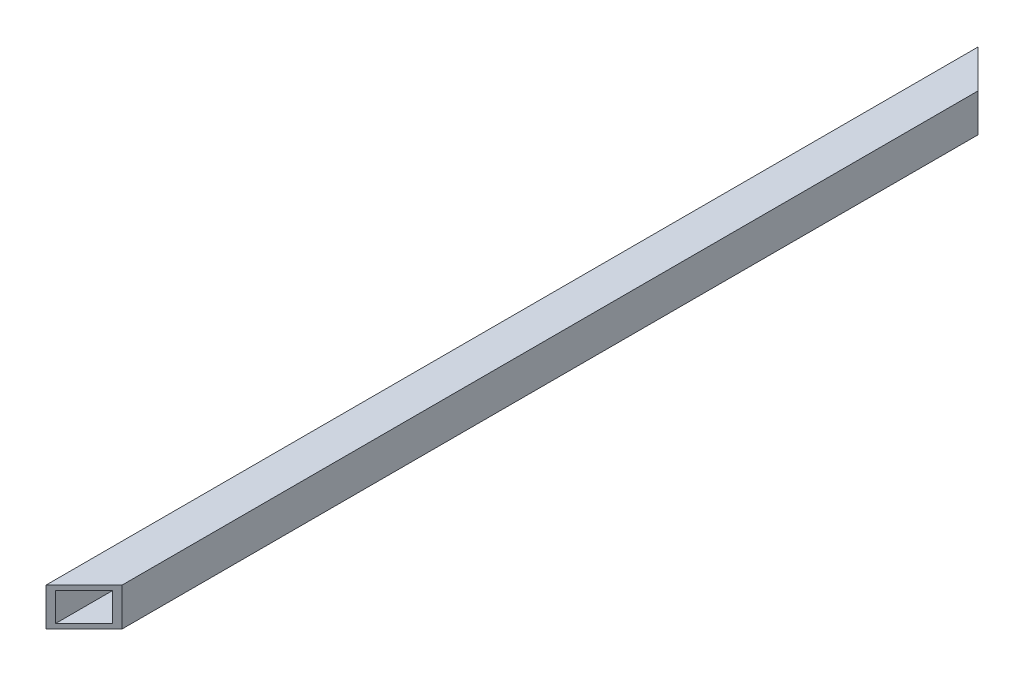
ISO-10303-21;
HEADER;
FILE_DESCRIPTION(('STEP AP214'),'2;1');
FILE_NAME('part.step','',(''),(''),'','','');
FILE_SCHEMA(('AUTOMOTIVE_DESIGN { 1 0 10303 214 1 1 1 1 }'));
ENDSEC;
DATA;
#1=APPLICATION_CONTEXT('core data for automotive mechanical design processes');
#2=APPLICATION_PROTOCOL_DEFINITION('international standard','automotive_design',2000,#1);
#3=PRODUCT_CONTEXT('',#1,'mechanical');
#4=PRODUCT('Part','Part','',(#3));
#5=PRODUCT_RELATED_PRODUCT_CATEGORY('part','',(#4));
#6=PRODUCT_DEFINITION_FORMATION('','',#4);
#7=PRODUCT_DEFINITION_CONTEXT('part definition',#1,'design');
#8=PRODUCT_DEFINITION('design','',#6,#7);
#9=PRODUCT_DEFINITION_SHAPE('','',#8);
#10=(LENGTH_UNIT() NAMED_UNIT(*) SI_UNIT(.MILLI.,.METRE.));
#11=(NAMED_UNIT(*) PLANE_ANGLE_UNIT() SI_UNIT($,.RADIAN.));
#12=(NAMED_UNIT(*) SI_UNIT($,.STERADIAN.) SOLID_ANGLE_UNIT());
#13=UNCERTAINTY_MEASURE_WITH_UNIT(LENGTH_MEASURE(1.E-05),#10,'distance_accuracy_value','');
#14=(GEOMETRIC_REPRESENTATION_CONTEXT(3) GLOBAL_UNCERTAINTY_ASSIGNED_CONTEXT((#13)) GLOBAL_UNIT_ASSIGNED_CONTEXT((#10,
#11,#12)) REPRESENTATION_CONTEXT('',''));
#15=CARTESIAN_POINT('',(0.,0.,0.));
#16=DIRECTION('',(0.,0.,1.));
#17=DIRECTION('',(1.,0.,0.));
#18=AXIS2_PLACEMENT_3D('',#15,#16,#17);
#19=CARTESIAN_POINT('',(-12.7,12.7,-311.15));
#20=DIRECTION('',(-0.707106781186548,0.,0.707106781186547));
#21=DIRECTION('',(0.707106781186547,0.,0.707106781186548));
#22=AXIS2_PLACEMENT_3D('',#19,#20,#21);
#23=PLANE('',#22);
#24=DIRECTION('',(0.707106781186547,0.,0.707106781186548));
#25=VECTOR('',#24,1.);
#26=CARTESIAN_POINT('',(71.4375,-12.7,-227.0125));
#27=LINE('',#26,#25);
#28=CARTESIAN_POINT('',(-12.7,-12.7,-311.15));
#29=VERTEX_POINT('',#28);
#30=CARTESIAN_POINT('',(12.7,-12.7,-285.75));
#31=VERTEX_POINT('',#30);
#32=EDGE_CURVE('E10',#29,#31,#27,.T.);
#33=ORIENTED_EDGE('',*,*,#32,.F.);
#34=DIRECTION('',(0.,-1.,0.));
#35=VECTOR('',#34,1.);
#36=CARTESIAN_POINT('',(-12.7,-12.7,-311.15));
#37=LINE('',#36,#35);
#38=CARTESIAN_POINT('',(-12.7,12.7,-311.15));
#39=VERTEX_POINT('',#38);
#40=EDGE_CURVE('E35',#39,#29,#37,.T.);
#41=ORIENTED_EDGE('',*,*,#40,.F.);
#42=DIRECTION('',(-0.707106781186547,0.,-0.707106781186548));
#43=VECTOR('',#42,1.);
#44=CARTESIAN_POINT('',(65.0875,12.7,-233.3625));
#45=LINE('',#44,#43);
#46=CARTESIAN_POINT('',(12.7,12.7,-285.75));
#47=VERTEX_POINT('',#46);
#48=EDGE_CURVE('E130',#47,#39,#45,.T.);
#49=ORIENTED_EDGE('',*,*,#48,.F.);
#50=DIRECTION('',(0.,1.,0.));
#51=VECTOR('',#50,1.);
#52=CARTESIAN_POINT('',(12.7,12.7,-285.75));
#53=LINE('',#52,#51);
#54=EDGE_CURVE('E114',#31,#47,#53,.T.);
#55=ORIENTED_EDGE('',*,*,#54,.F.);
#56=EDGE_LOOP('',(#33,#41,#49,#55));
#57=FACE_BOUND('',#56,.T.);
#58=DIRECTION('',(0.,-1.,0.));
#59=VECTOR('',#58,1.);
#60=CARTESIAN_POINT('',(9.525,11.1125,-288.925));
#61=LINE('',#60,#59);
#62=CARTESIAN_POINT('',(9.525,9.525,-288.925));
#63=VERTEX_POINT('',#62);
#64=CARTESIAN_POINT('',(9.525,-9.525,-288.925));
#65=VERTEX_POINT('',#64);
#66=EDGE_CURVE('E92',#63,#65,#61,.T.);
#67=ORIENTED_EDGE('',*,*,#66,.F.);
#68=DIRECTION('',(0.707106781186547,0.,0.707106781186548));
#69=VECTOR('',#68,1.);
#70=CARTESIAN_POINT('',(65.88125,9.525,-232.56875));
#71=LINE('',#70,#69);
#72=CARTESIAN_POINT('',(-9.525,9.525,-307.975));
#73=VERTEX_POINT('',#72);
#74=EDGE_CURVE('E100',#73,#63,#71,.T.);
#75=ORIENTED_EDGE('',*,*,#74,.F.);
#76=DIRECTION('',(0.,1.,0.));
#77=VECTOR('',#76,1.);
#78=CARTESIAN_POINT('',(-9.52500000000001,1.5875,-307.975));
#79=LINE('',#78,#77);
#80=CARTESIAN_POINT('',(-9.525,-9.525,-307.975));
#81=VERTEX_POINT('',#80);
#82=EDGE_CURVE('E101',#81,#73,#79,.T.);
#83=ORIENTED_EDGE('',*,*,#82,.F.);
#84=DIRECTION('',(-0.707106781186547,0.,-0.707106781186548));
#85=VECTOR('',#84,1.);
#86=CARTESIAN_POINT('',(70.64375,-9.525,-227.80625));
#87=LINE('',#86,#85);
#88=EDGE_CURVE('E111',#65,#81,#87,.T.);
#89=ORIENTED_EDGE('',*,*,#88,.F.);
#90=EDGE_LOOP('',(#67,#75,#83,#89));
#91=FACE_BOUND('',#90,.T.);
#92=ADVANCED_FACE('F16',(#57,#91),#23,.F.);
#93=CARTESIAN_POINT('',(12.7,12.7,285.75));
#94=DIRECTION('',(-0.707106781186548,0.,-0.707106781186547));
#95=DIRECTION('',(-0.707106781186547,0.,0.707106781186548));
#96=AXIS2_PLACEMENT_3D('',#93,#94,#95);
#97=PLANE('',#96);
#98=DIRECTION('',(-0.707106781186547,0.,0.707106781186548));
#99=VECTOR('',#98,1.);
#100=CARTESIAN_POINT('',(84.1375,-12.7,214.3125));
#101=LINE('',#100,#99);
#102=CARTESIAN_POINT('',(12.7,-12.7,285.75));
#103=VERTEX_POINT('',#102);
#104=CARTESIAN_POINT('',(-12.7,-12.7,311.15));
#105=VERTEX_POINT('',#104);
#106=EDGE_CURVE('E26',#103,#105,#101,.T.);
#107=ORIENTED_EDGE('',*,*,#106,.F.);
#108=DIRECTION('',(0.,-1.,0.));
#109=VECTOR('',#108,1.);
#110=CARTESIAN_POINT('',(12.7,12.7,285.75));
#111=LINE('',#110,#109);
#112=CARTESIAN_POINT('',(12.7,12.7,285.75));
#113=VERTEX_POINT('',#112);
#114=EDGE_CURVE('E117',#113,#103,#111,.T.);
#115=ORIENTED_EDGE('',*,*,#114,.F.);
#116=DIRECTION('',(0.707106781186547,0.,-0.707106781186548));
#117=VECTOR('',#116,1.);
#118=CARTESIAN_POINT('',(77.7875,12.7,220.6625));
#119=LINE('',#118,#117);
#120=CARTESIAN_POINT('',(-12.7,12.7,311.15));
#121=VERTEX_POINT('',#120);
#122=EDGE_CURVE('E133',#121,#113,#119,.T.);
#123=ORIENTED_EDGE('',*,*,#122,.F.);
#124=DIRECTION('',(0.,1.,0.));
#125=VECTOR('',#124,1.);
#126=CARTESIAN_POINT('',(-12.7,-12.7,311.15));
#127=LINE('',#126,#125);
#128=EDGE_CURVE('E126',#105,#121,#127,.T.);
#129=ORIENTED_EDGE('',*,*,#128,.F.);
#130=EDGE_LOOP('',(#107,#115,#123,#129));
#131=FACE_BOUND('',#130,.T.);
#132=DIRECTION('',(0.,1.,0.));
#133=VECTOR('',#132,1.);
#134=CARTESIAN_POINT('',(9.52500000000001,11.1125,288.925));
#135=LINE('',#134,#133);
#136=CARTESIAN_POINT('',(9.525,-9.525,288.925));
#137=VERTEX_POINT('',#136);
#138=CARTESIAN_POINT('',(9.525,9.525,288.925));
#139=VERTEX_POINT('',#138);
#140=EDGE_CURVE('E120',#137,#139,#135,.T.);
#141=ORIENTED_EDGE('',*,*,#140,.F.);
#142=DIRECTION('',(0.707106781186547,0.,-0.707106781186548));
#143=VECTOR('',#142,1.);
#144=CARTESIAN_POINT('',(83.34375,-9.525,215.10625));
#145=LINE('',#144,#143);
#146=CARTESIAN_POINT('',(-9.525,-9.525,307.975));
#147=VERTEX_POINT('',#146);
#148=EDGE_CURVE('E79',#147,#137,#145,.T.);
#149=ORIENTED_EDGE('',*,*,#148,.F.);
#150=DIRECTION('',(0.,-1.,0.));
#151=VECTOR('',#150,1.);
#152=CARTESIAN_POINT('',(-9.52499999999998,1.5875,307.975));
#153=LINE('',#152,#151);
#154=CARTESIAN_POINT('',(-9.525,9.525,307.975));
#155=VERTEX_POINT('',#154);
#156=EDGE_CURVE('E82',#155,#147,#153,.T.);
#157=ORIENTED_EDGE('',*,*,#156,.F.);
#158=DIRECTION('',(-0.707106781186547,0.,0.707106781186548));
#159=VECTOR('',#158,1.);
#160=CARTESIAN_POINT('',(78.58125,9.525,219.86875));
#161=LINE('',#160,#159);
#162=EDGE_CURVE('E85',#139,#155,#161,.T.);
#163=ORIENTED_EDGE('',*,*,#162,.F.);
#164=EDGE_LOOP('',(#141,#149,#157,#163));
#165=FACE_BOUND('',#164,.T.);
#166=ADVANCED_FACE('F84',(#131,#165),#97,.F.);
#167=CARTESIAN_POINT('',(12.7,-12.7,0.));
#168=DIRECTION('',(0.,-1.,0.));
#169=DIRECTION('',(0.,0.,-1.));
#170=AXIS2_PLACEMENT_3D('',#167,#168,#169);
#171=PLANE('',#170);
#172=ORIENTED_EDGE('',*,*,#32,.T.);
#173=DIRECTION('',(0.,0.,-1.));
#174=VECTOR('',#173,1.);
#175=CARTESIAN_POINT('',(12.7,-12.7,0.));
#176=LINE('',#175,#174);
#177=EDGE_CURVE('E123',#103,#31,#176,.T.);
#178=ORIENTED_EDGE('',*,*,#177,.F.);
#179=ORIENTED_EDGE('',*,*,#106,.T.);
#180=DIRECTION('',(0.,0.,-1.));
#181=VECTOR('',#180,1.);
#182=CARTESIAN_POINT('',(-12.7,-12.7,0.));
#183=LINE('',#182,#181);
#184=EDGE_CURVE('E127',#105,#29,#183,.T.);
#185=ORIENTED_EDGE('',*,*,#184,.T.);
#186=EDGE_LOOP('',(#172,#178,#179,#185));
#187=FACE_BOUND('',#186,.T.);
#188=ADVANCED_FACE('F165',(#187),#171,.T.);
#189=CARTESIAN_POINT('',(-12.7,12.7,0.));
#190=DIRECTION('',(0.,1.,0.));
#191=DIRECTION('',(0.,0.,1.));
#192=AXIS2_PLACEMENT_3D('',#189,#190,#191);
#193=PLANE('',#192);
#194=ORIENTED_EDGE('',*,*,#48,.T.);
#195=DIRECTION('',(0.,0.,1.));
#196=VECTOR('',#195,1.);
#197=CARTESIAN_POINT('',(-12.7,12.7,0.));
#198=LINE('',#197,#196);
#199=EDGE_CURVE('E131',#39,#121,#198,.T.);
#200=ORIENTED_EDGE('',*,*,#199,.T.);
#201=ORIENTED_EDGE('',*,*,#122,.T.);
#202=DIRECTION('',(0.,0.,-1.));
#203=VECTOR('',#202,1.);
#204=CARTESIAN_POINT('',(12.7,12.7,0.));
#205=LINE('',#204,#203);
#206=EDGE_CURVE('E134',#113,#47,#205,.T.);
#207=ORIENTED_EDGE('',*,*,#206,.T.);
#208=EDGE_LOOP('',(#194,#200,#201,#207));
#209=FACE_BOUND('',#208,.T.);
#210=ADVANCED_FACE('F150',(#209),#193,.T.);
#211=CARTESIAN_POINT('',(-9.525,9.525,0.));
#212=DIRECTION('',(0.,1.,0.));
#213=DIRECTION('',(0.,0.,1.));
#214=AXIS2_PLACEMENT_3D('',#211,#212,#213);
#215=PLANE('',#214);
#216=ORIENTED_EDGE('',*,*,#74,.T.);
#217=DIRECTION('',(0.,0.,-1.));
#218=VECTOR('',#217,1.);
#219=CARTESIAN_POINT('',(9.525,9.525,0.));
#220=LINE('',#219,#218);
#221=EDGE_CURVE('E99',#139,#63,#220,.T.);
#222=ORIENTED_EDGE('',*,*,#221,.F.);
#223=ORIENTED_EDGE('',*,*,#162,.T.);
#224=DIRECTION('',(0.,0.,1.));
#225=VECTOR('',#224,1.);
#226=CARTESIAN_POINT('',(-9.525,9.525,0.));
#227=LINE('',#226,#225);
#228=EDGE_CURVE('E91',#73,#155,#227,.T.);
#229=ORIENTED_EDGE('',*,*,#228,.F.);
#230=EDGE_LOOP('',(#216,#222,#223,#229));
#231=FACE_BOUND('',#230,.T.);
#232=ADVANCED_FACE('F97',(#231),#215,.F.);
#233=CARTESIAN_POINT('',(-9.525,-9.525,0.));
#234=DIRECTION('',(-1.,0.,0.));
#235=DIRECTION('',(0.,0.,1.));
#236=AXIS2_PLACEMENT_3D('',#233,#234,#235);
#237=PLANE('',#236);
#238=ORIENTED_EDGE('',*,*,#82,.T.);
#239=ORIENTED_EDGE('',*,*,#228,.T.);
#240=ORIENTED_EDGE('',*,*,#156,.T.);
#241=DIRECTION('',(0.,0.,1.));
#242=VECTOR('',#241,1.);
#243=CARTESIAN_POINT('',(-9.525,-9.525,0.));
#244=LINE('',#243,#242);
#245=EDGE_CURVE('E110',#81,#147,#244,.T.);
#246=ORIENTED_EDGE('',*,*,#245,.F.);
#247=EDGE_LOOP('',(#238,#239,#240,#246));
#248=FACE_BOUND('',#247,.T.);
#249=ADVANCED_FACE('F103',(#248),#237,.F.);
#250=CARTESIAN_POINT('',(9.525,9.525,0.));
#251=DIRECTION('',(1.,0.,0.));
#252=DIRECTION('',(0.,0.,-1.));
#253=AXIS2_PLACEMENT_3D('',#250,#251,#252);
#254=PLANE('',#253);
#255=ORIENTED_EDGE('',*,*,#66,.T.);
#256=DIRECTION('',(0.,0.,1.));
#257=VECTOR('',#256,1.);
#258=CARTESIAN_POINT('',(9.525,-9.525,0.));
#259=LINE('',#258,#257);
#260=EDGE_CURVE('E20',#65,#137,#259,.T.);
#261=ORIENTED_EDGE('',*,*,#260,.T.);
#262=ORIENTED_EDGE('',*,*,#140,.T.);
#263=ORIENTED_EDGE('',*,*,#221,.T.);
#264=EDGE_LOOP('',(#255,#261,#262,#263));
#265=FACE_BOUND('',#264,.T.);
#266=ADVANCED_FACE('F179',(#265),#254,.F.);
#267=CARTESIAN_POINT('',(9.525,-9.525,0.));
#268=DIRECTION('',(0.,-1.,0.));
#269=DIRECTION('',(0.,0.,-1.));
#270=AXIS2_PLACEMENT_3D('',#267,#268,#269);
#271=PLANE('',#270);
#272=ORIENTED_EDGE('',*,*,#88,.T.);
#273=ORIENTED_EDGE('',*,*,#245,.T.);
#274=ORIENTED_EDGE('',*,*,#148,.T.);
#275=ORIENTED_EDGE('',*,*,#260,.F.);
#276=EDGE_LOOP('',(#272,#273,#274,#275));
#277=FACE_BOUND('',#276,.T.);
#278=ADVANCED_FACE('F158',(#277),#271,.F.);
#279=CARTESIAN_POINT('',(12.7,12.7,0.));
#280=DIRECTION('',(1.,0.,0.));
#281=DIRECTION('',(0.,0.,-1.));
#282=AXIS2_PLACEMENT_3D('',#279,#280,#281);
#283=PLANE('',#282);
#284=ORIENTED_EDGE('',*,*,#54,.T.);
#285=ORIENTED_EDGE('',*,*,#206,.F.);
#286=ORIENTED_EDGE('',*,*,#114,.T.);
#287=ORIENTED_EDGE('',*,*,#177,.T.);
#288=EDGE_LOOP('',(#284,#285,#286,#287));
#289=FACE_BOUND('',#288,.T.);
#290=ADVANCED_FACE('F153',(#289),#283,.T.);
#291=CARTESIAN_POINT('',(-12.7,-12.7,0.));
#292=DIRECTION('',(-1.,0.,0.));
#293=DIRECTION('',(0.,0.,1.));
#294=AXIS2_PLACEMENT_3D('',#291,#292,#293);
#295=PLANE('',#294);
#296=ORIENTED_EDGE('',*,*,#128,.T.);
#297=ORIENTED_EDGE('',*,*,#199,.F.);
#298=ORIENTED_EDGE('',*,*,#40,.T.);
#299=ORIENTED_EDGE('',*,*,#184,.F.);
#300=EDGE_LOOP('',(#296,#297,#298,#299));
#301=FACE_BOUND('',#300,.T.);
#302=ADVANCED_FACE('F18',(#301),#295,.T.);
#303=CLOSED_SHELL('',(#92,#166,#188,#210,#232,#249,#266,#278,#290,#302));
#304=MANIFOLD_SOLID_BREP('B1',#303);
#305=ADVANCED_BREP_SHAPE_REPRESENTATION('',(#18,#304),#14);
#306=SHAPE_DEFINITION_REPRESENTATION(#9,#305);
ENDSEC;
END-ISO-10303-21;
